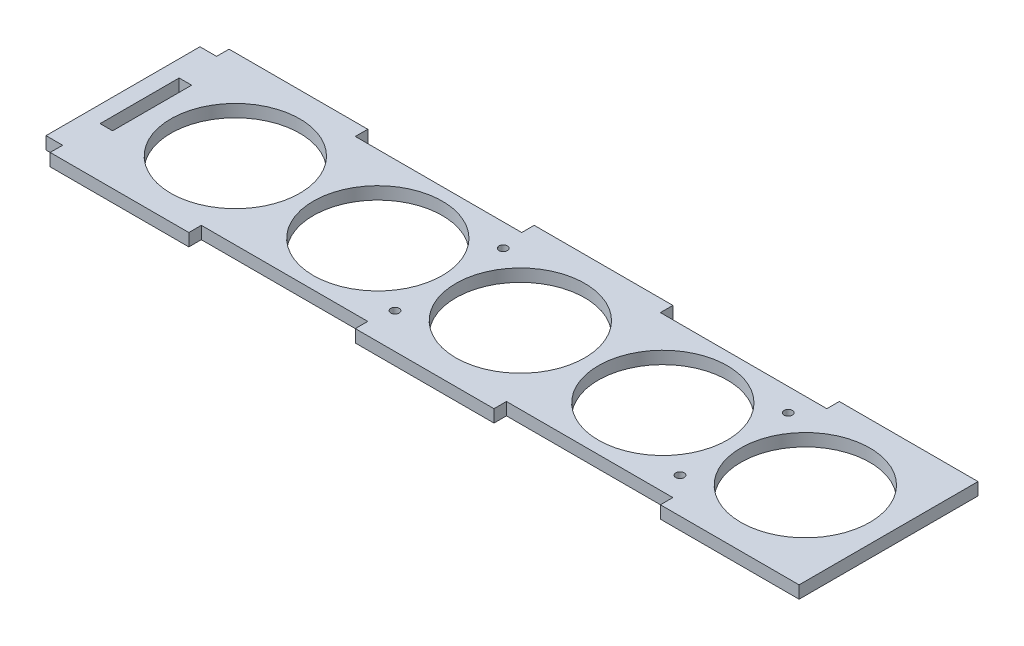
ISO-10303-21;
HEADER;
FILE_DESCRIPTION(('STEP AP214'),'2;1');
FILE_NAME('part.step','',(''),(''),'','','');
FILE_SCHEMA(('AUTOMOTIVE_DESIGN { 1 0 10303 214 1 1 1 1 }'));
ENDSEC;
DATA;
#1=APPLICATION_CONTEXT('core data for automotive mechanical design processes');
#2=APPLICATION_PROTOCOL_DEFINITION('international standard','automotive_design',2000,#1);
#3=PRODUCT_CONTEXT('',#1,'mechanical');
#4=PRODUCT('Part','Part','',(#3));
#5=PRODUCT_RELATED_PRODUCT_CATEGORY('part','',(#4));
#6=PRODUCT_DEFINITION_FORMATION('','',#4);
#7=PRODUCT_DEFINITION_CONTEXT('part definition',#1,'design');
#8=PRODUCT_DEFINITION('design','',#6,#7);
#9=PRODUCT_DEFINITION_SHAPE('','',#8);
#10=(LENGTH_UNIT() NAMED_UNIT(*) SI_UNIT(.MILLI.,.METRE.));
#11=(NAMED_UNIT(*) PLANE_ANGLE_UNIT() SI_UNIT($,.RADIAN.));
#12=(NAMED_UNIT(*) SI_UNIT($,.STERADIAN.) SOLID_ANGLE_UNIT());
#13=UNCERTAINTY_MEASURE_WITH_UNIT(LENGTH_MEASURE(1.E-05),#10,'distance_accuracy_value','');
#14=(GEOMETRIC_REPRESENTATION_CONTEXT(3) GLOBAL_UNCERTAINTY_ASSIGNED_CONTEXT((#13)) GLOBAL_UNIT_ASSIGNED_CONTEXT((#10,
#11,#12)) REPRESENTATION_CONTEXT('',''));
#15=CARTESIAN_POINT('',(0.,0.,0.));
#16=DIRECTION('',(0.,0.,1.));
#17=DIRECTION('',(1.,0.,0.));
#18=AXIS2_PLACEMENT_3D('',#15,#16,#17);
#19=CARTESIAN_POINT('',(74.375,3.,13.));
#20=DIRECTION('',(0.,-1.,0.));
#21=DIRECTION('',(0.,0.,-1.));
#22=AXIS2_PLACEMENT_3D('',#19,#20,#21);
#23=CYLINDRICAL_SURFACE('',#22,0.999999999999998);
#24=CARTESIAN_POINT('',(74.375,3.,13.));
#25=DIRECTION('',(0.,1.,0.));
#26=DIRECTION('',(0.,0.,1.));
#27=AXIS2_PLACEMENT_3D('',#24,#25,#26);
#28=CIRCLE('',#27,0.999999999999998);
#29=CARTESIAN_POINT('',(74.375,3.,14.));
#30=VERTEX_POINT('',#29);
#31=EDGE_CURVE('E150',#30,#30,#28,.F.);
#32=ORIENTED_EDGE('',*,*,#31,.F.);
#33=EDGE_LOOP('',(#32));
#34=FACE_BOUND('',#33,.T.);
#35=CARTESIAN_POINT('',(74.375,0.,13.));
#36=DIRECTION('',(0.,1.,0.));
#37=DIRECTION('',(0.,0.,1.));
#38=AXIS2_PLACEMENT_3D('',#35,#36,#37);
#39=CIRCLE('',#38,0.999999999999998);
#40=CARTESIAN_POINT('',(74.375,0.,14.));
#41=VERTEX_POINT('',#40);
#42=EDGE_CURVE('E243',#41,#41,#39,.F.);
#43=ORIENTED_EDGE('',*,*,#42,.T.);
#44=EDGE_LOOP('',(#43));
#45=FACE_BOUND('',#44,.T.);
#46=ADVANCED_FACE('F39',(#34,#45),#23,.F.);
#47=CARTESIAN_POINT('',(33.3333333333333,3.,0.));
#48=DIRECTION('',(-1.,0.,0.));
#49=DIRECTION('',(0.,0.,1.));
#50=AXIS2_PLACEMENT_3D('',#47,#48,#49);
#51=PLANE('',#50);
#52=DIRECTION('',(0.,0.,-1.));
#53=VECTOR('',#52,1.);
#54=CARTESIAN_POINT('',(33.3333333333333,0.,0.));
#55=LINE('',#54,#53);
#56=CARTESIAN_POINT('',(33.3333333333333,0.,21.5));
#57=VERTEX_POINT('',#56);
#58=CARTESIAN_POINT('',(33.3333333333333,0.,18.5));
#59=VERTEX_POINT('',#58);
#60=EDGE_CURVE('E186',#57,#59,#55,.T.);
#61=ORIENTED_EDGE('',*,*,#60,.T.);
#62=DIRECTION('',(0.,-1.,0.));
#63=VECTOR('',#62,1.);
#64=CARTESIAN_POINT('',(33.3333333333333,3.,18.5));
#65=LINE('',#64,#63);
#66=CARTESIAN_POINT('',(33.3333333333333,3.,18.5));
#67=VERTEX_POINT('',#66);
#68=EDGE_CURVE('E307',#67,#59,#65,.T.);
#69=ORIENTED_EDGE('',*,*,#68,.F.);
#70=DIRECTION('',(0.,0.,-1.));
#71=VECTOR('',#70,1.);
#72=CARTESIAN_POINT('',(33.3333333333333,3.,0.));
#73=LINE('',#72,#71);
#74=CARTESIAN_POINT('',(33.3333333333333,3.,21.5));
#75=VERTEX_POINT('',#74);
#76=EDGE_CURVE('E536',#75,#67,#73,.T.);
#77=ORIENTED_EDGE('',*,*,#76,.F.);
#78=DIRECTION('',(0.,-1.,0.));
#79=VECTOR('',#78,1.);
#80=CARTESIAN_POINT('',(33.3333333333333,3.,21.5));
#81=LINE('',#80,#79);
#82=EDGE_CURVE('E310',#75,#57,#81,.T.);
#83=ORIENTED_EDGE('',*,*,#82,.T.);
#84=EDGE_LOOP('',(#61,#69,#77,#83));
#85=FACE_BOUND('',#84,.T.);
#86=ADVANCED_FACE('F433',(#85),#51,.F.);
#87=CARTESIAN_POINT('',(0.,3.,18.5));
#88=DIRECTION('',(0.,0.,-1.));
#89=DIRECTION('',(-1.,0.,0.));
#90=AXIS2_PLACEMENT_3D('',#87,#88,#89);
#91=PLANE('',#90);
#92=DIRECTION('',(1.,0.,0.));
#93=VECTOR('',#92,1.);
#94=CARTESIAN_POINT('',(0.,0.,18.5));
#95=LINE('',#94,#93);
#96=CARTESIAN_POINT('',(73.3333333333333,0.,18.5));
#97=VERTEX_POINT('',#96);
#98=EDGE_CURVE('E191',#59,#97,#95,.T.);
#99=ORIENTED_EDGE('',*,*,#98,.T.);
#100=DIRECTION('',(0.,-1.,0.));
#101=VECTOR('',#100,1.);
#102=CARTESIAN_POINT('',(73.3333333333333,3.,18.5));
#103=LINE('',#102,#101);
#104=CARTESIAN_POINT('',(73.3333333333333,3.,18.5));
#105=VERTEX_POINT('',#104);
#106=EDGE_CURVE('E304',#105,#97,#103,.T.);
#107=ORIENTED_EDGE('',*,*,#106,.F.);
#108=DIRECTION('',(1.,0.,0.));
#109=VECTOR('',#108,1.);
#110=CARTESIAN_POINT('',(0.,3.,18.5));
#111=LINE('',#110,#109);
#112=EDGE_CURVE('E530',#67,#105,#111,.T.);
#113=ORIENTED_EDGE('',*,*,#112,.F.);
#114=ORIENTED_EDGE('',*,*,#68,.T.);
#115=EDGE_LOOP('',(#99,#107,#113,#114));
#116=FACE_BOUND('',#115,.T.);
#117=ADVANCED_FACE('F439',(#116),#91,.F.);
#118=CARTESIAN_POINT('',(73.3333333333333,3.,0.));
#119=DIRECTION('',(-1.,0.,0.));
#120=DIRECTION('',(0.,0.,1.));
#121=AXIS2_PLACEMENT_3D('',#118,#119,#120);
#122=PLANE('',#121);
#123=DIRECTION('',(0.,0.,-1.));
#124=VECTOR('',#123,1.);
#125=CARTESIAN_POINT('',(73.3333333333333,0.,0.));
#126=LINE('',#125,#124);
#127=CARTESIAN_POINT('',(73.3333333333333,0.,21.5));
#128=VERTEX_POINT('',#127);
#129=EDGE_CURVE('E194',#128,#97,#126,.T.);
#130=ORIENTED_EDGE('',*,*,#129,.F.);
#131=DIRECTION('',(0.,-1.,0.));
#132=VECTOR('',#131,1.);
#133=CARTESIAN_POINT('',(73.3333333333333,3.,21.5));
#134=LINE('',#133,#132);
#135=CARTESIAN_POINT('',(73.3333333333333,3.,21.5));
#136=VERTEX_POINT('',#135);
#137=EDGE_CURVE('E301',#136,#128,#134,.T.);
#138=ORIENTED_EDGE('',*,*,#137,.F.);
#139=DIRECTION('',(0.,0.,-1.));
#140=VECTOR('',#139,1.);
#141=CARTESIAN_POINT('',(73.3333333333333,3.,0.));
#142=LINE('',#141,#140);
#143=EDGE_CURVE('E523',#136,#105,#142,.T.);
#144=ORIENTED_EDGE('',*,*,#143,.T.);
#145=ORIENTED_EDGE('',*,*,#106,.T.);
#146=EDGE_LOOP('',(#130,#138,#144,#145));
#147=FACE_BOUND('',#146,.T.);
#148=ADVANCED_FACE('F503',(#147),#122,.T.);
#149=CARTESIAN_POINT('',(0.,3.,21.5));
#150=DIRECTION('',(0.,0.,-1.));
#151=DIRECTION('',(-1.,0.,0.));
#152=AXIS2_PLACEMENT_3D('',#149,#150,#151);
#153=PLANE('',#152);
#154=DIRECTION('',(1.,0.,0.));
#155=VECTOR('',#154,1.);
#156=CARTESIAN_POINT('',(0.,0.,21.5));
#157=LINE('',#156,#155);
#158=CARTESIAN_POINT('',(106.666666666667,0.,21.4999999999999));
#159=VERTEX_POINT('',#158);
#160=EDGE_CURVE('E188',#128,#159,#157,.T.);
#161=ORIENTED_EDGE('',*,*,#160,.T.);
#162=DIRECTION('',(0.,-1.,0.));
#163=VECTOR('',#162,1.);
#164=CARTESIAN_POINT('',(106.666666666667,3.,21.4999999999999));
#165=LINE('',#164,#163);
#166=CARTESIAN_POINT('',(106.666666666667,3.,21.4999999999999));
#167=VERTEX_POINT('',#166);
#168=EDGE_CURVE('E298',#167,#159,#165,.T.);
#169=ORIENTED_EDGE('',*,*,#168,.F.);
#170=DIRECTION('',(1.,0.,0.));
#171=VECTOR('',#170,1.);
#172=CARTESIAN_POINT('',(0.,3.,21.5));
#173=LINE('',#172,#171);
#174=EDGE_CURVE('E529',#136,#167,#173,.T.);
#175=ORIENTED_EDGE('',*,*,#174,.F.);
#176=ORIENTED_EDGE('',*,*,#137,.T.);
#177=EDGE_LOOP('',(#161,#169,#175,#176));
#178=FACE_BOUND('',#177,.T.);
#179=ADVANCED_FACE('F413',(#178),#153,.F.);
#180=CARTESIAN_POINT('',(106.666666666667,3.,0.));
#181=DIRECTION('',(-1.,0.,0.));
#182=DIRECTION('',(0.,0.,1.));
#183=AXIS2_PLACEMENT_3D('',#180,#181,#182);
#184=PLANE('',#183);
#185=DIRECTION('',(0.,0.,-1.));
#186=VECTOR('',#185,1.);
#187=CARTESIAN_POINT('',(106.666666666667,0.,0.));
#188=LINE('',#187,#186);
#189=CARTESIAN_POINT('',(106.666666666667,0.,18.5));
#190=VERTEX_POINT('',#189);
#191=EDGE_CURVE('E197',#159,#190,#188,.T.);
#192=ORIENTED_EDGE('',*,*,#191,.T.);
#193=DIRECTION('',(0.,-1.,0.));
#194=VECTOR('',#193,1.);
#195=CARTESIAN_POINT('',(106.666666666667,3.,18.5));
#196=LINE('',#195,#194);
#197=CARTESIAN_POINT('',(106.666666666667,3.,18.5));
#198=VERTEX_POINT('',#197);
#199=EDGE_CURVE('E295',#198,#190,#196,.T.);
#200=ORIENTED_EDGE('',*,*,#199,.F.);
#201=DIRECTION('',(0.,0.,-1.));
#202=VECTOR('',#201,1.);
#203=CARTESIAN_POINT('',(106.666666666667,3.,0.));
#204=LINE('',#203,#202);
#205=EDGE_CURVE('E532',#167,#198,#204,.T.);
#206=ORIENTED_EDGE('',*,*,#205,.F.);
#207=ORIENTED_EDGE('',*,*,#168,.T.);
#208=EDGE_LOOP('',(#192,#200,#206,#207));
#209=FACE_BOUND('',#208,.T.);
#210=ADVANCED_FACE('F498',(#209),#184,.F.);
#211=CARTESIAN_POINT('',(0.,3.,18.5));
#212=DIRECTION('',(0.,0.,-1.));
#213=DIRECTION('',(-1.,0.,0.));
#214=AXIS2_PLACEMENT_3D('',#211,#212,#213);
#215=PLANE('',#214);
#216=DIRECTION('',(1.,0.,0.));
#217=VECTOR('',#216,1.);
#218=CARTESIAN_POINT('',(0.,0.,18.5));
#219=LINE('',#218,#217);
#220=CARTESIAN_POINT('',(146.666666666667,0.,18.5));
#221=VERTEX_POINT('',#220);
#222=EDGE_CURVE('E200',#190,#221,#219,.T.);
#223=ORIENTED_EDGE('',*,*,#222,.T.);
#224=DIRECTION('',(0.,-1.,0.));
#225=VECTOR('',#224,1.);
#226=CARTESIAN_POINT('',(146.666666666667,3.,18.5));
#227=LINE('',#226,#225);
#228=CARTESIAN_POINT('',(146.666666666667,3.,18.5));
#229=VERTEX_POINT('',#228);
#230=EDGE_CURVE('E292',#229,#221,#227,.T.);
#231=ORIENTED_EDGE('',*,*,#230,.F.);
#232=DIRECTION('',(1.,0.,0.));
#233=VECTOR('',#232,1.);
#234=CARTESIAN_POINT('',(0.,3.,18.5));
#235=LINE('',#234,#233);
#236=EDGE_CURVE('E542',#198,#229,#235,.T.);
#237=ORIENTED_EDGE('',*,*,#236,.F.);
#238=ORIENTED_EDGE('',*,*,#199,.T.);
#239=EDGE_LOOP('',(#223,#231,#237,#238));
#240=FACE_BOUND('',#239,.T.);
#241=ADVANCED_FACE('F494',(#240),#215,.F.);
#242=CARTESIAN_POINT('',(146.666666666667,3.,0.));
#243=DIRECTION('',(-1.,0.,0.));
#244=DIRECTION('',(0.,0.,1.));
#245=AXIS2_PLACEMENT_3D('',#242,#243,#244);
#246=PLANE('',#245);
#247=DIRECTION('',(0.,0.,-1.));
#248=VECTOR('',#247,1.);
#249=CARTESIAN_POINT('',(146.666666666667,0.,0.));
#250=LINE('',#249,#248);
#251=CARTESIAN_POINT('',(146.666666666667,0.,21.4999999999999));
#252=VERTEX_POINT('',#251);
#253=EDGE_CURVE('E203',#252,#221,#250,.T.);
#254=ORIENTED_EDGE('',*,*,#253,.F.);
#255=DIRECTION('',(0.,-1.,0.));
#256=VECTOR('',#255,1.);
#257=CARTESIAN_POINT('',(146.666666666667,3.,21.4999999999999));
#258=LINE('',#257,#256);
#259=CARTESIAN_POINT('',(146.666666666667,3.,21.4999999999999));
#260=VERTEX_POINT('',#259);
#261=EDGE_CURVE('E289',#260,#252,#258,.T.);
#262=ORIENTED_EDGE('',*,*,#261,.F.);
#263=DIRECTION('',(0.,0.,-1.));
#264=VECTOR('',#263,1.);
#265=CARTESIAN_POINT('',(146.666666666667,3.,0.));
#266=LINE('',#265,#264);
#267=EDGE_CURVE('E545',#260,#229,#266,.T.);
#268=ORIENTED_EDGE('',*,*,#267,.T.);
#269=ORIENTED_EDGE('',*,*,#230,.T.);
#270=EDGE_LOOP('',(#254,#262,#268,#269));
#271=FACE_BOUND('',#270,.T.);
#272=ADVANCED_FACE('F490',(#271),#246,.T.);
#273=CARTESIAN_POINT('',(180.,0.,21.4999999999999));
#274=VERTEX_POINT('',#273);
#275=EDGE_CURVE('E187',#252,#274,#157,.T.);
#276=ORIENTED_EDGE('',*,*,#275,.T.);
#277=DIRECTION('',(0.,-1.,0.));
#278=VECTOR('',#277,1.);
#279=CARTESIAN_POINT('',(180.,3.,21.4999999999999));
#280=LINE('',#279,#278);
#281=CARTESIAN_POINT('',(180.,3.,21.4999999999999));
#282=VERTEX_POINT('',#281);
#283=EDGE_CURVE('E286',#282,#274,#280,.T.);
#284=ORIENTED_EDGE('',*,*,#283,.F.);
#285=EDGE_CURVE('E535',#260,#282,#173,.T.);
#286=ORIENTED_EDGE('',*,*,#285,.F.);
#287=ORIENTED_EDGE('',*,*,#261,.T.);
#288=EDGE_LOOP('',(#276,#284,#286,#287));
#289=FACE_BOUND('',#288,.T.);
#290=ADVANCED_FACE('F414',(#289),#153,.F.);
#291=CARTESIAN_POINT('',(180.,3.,0.));
#292=DIRECTION('',(1.,0.,0.));
#293=DIRECTION('',(0.,0.,-1.));
#294=AXIS2_PLACEMENT_3D('',#291,#292,#293);
#295=PLANE('',#294);
#296=DIRECTION('',(0.,0.,1.));
#297=VECTOR('',#296,1.);
#298=CARTESIAN_POINT('',(180.,0.,0.));
#299=LINE('',#298,#297);
#300=CARTESIAN_POINT('',(180.,0.,-21.5));
#301=VERTEX_POINT('',#300);
#302=EDGE_CURVE('E206',#301,#274,#299,.T.);
#303=ORIENTED_EDGE('',*,*,#302,.F.);
#304=DIRECTION('',(0.,-1.,0.));
#305=VECTOR('',#304,1.);
#306=CARTESIAN_POINT('',(180.,3.,-21.5));
#307=LINE('',#306,#305);
#308=CARTESIAN_POINT('',(180.,3.,-21.5));
#309=VERTEX_POINT('',#308);
#310=EDGE_CURVE('E283',#309,#301,#307,.T.);
#311=ORIENTED_EDGE('',*,*,#310,.F.);
#312=DIRECTION('',(0.,0.,1.));
#313=VECTOR('',#312,1.);
#314=CARTESIAN_POINT('',(180.,3.,0.));
#315=LINE('',#314,#313);
#316=EDGE_CURVE('E548',#309,#282,#315,.T.);
#317=ORIENTED_EDGE('',*,*,#316,.T.);
#318=ORIENTED_EDGE('',*,*,#283,.T.);
#319=EDGE_LOOP('',(#303,#311,#317,#318));
#320=FACE_BOUND('',#319,.T.);
#321=ADVANCED_FACE('F485',(#320),#295,.T.);
#322=CARTESIAN_POINT('',(0.,3.,-21.5));
#323=DIRECTION('',(0.,0.,-1.));
#324=DIRECTION('',(-1.,0.,0.));
#325=AXIS2_PLACEMENT_3D('',#322,#323,#324);
#326=PLANE('',#325);
#327=DIRECTION('',(1.,0.,0.));
#328=VECTOR('',#327,1.);
#329=CARTESIAN_POINT('',(0.,0.,-21.5));
#330=LINE('',#329,#328);
#331=CARTESIAN_POINT('',(146.666666666667,0.,-21.5));
#332=VERTEX_POINT('',#331);
#333=EDGE_CURVE('E209',#332,#301,#330,.T.);
#334=ORIENTED_EDGE('',*,*,#333,.F.);
#335=DIRECTION('',(0.,-1.,0.));
#336=VECTOR('',#335,1.);
#337=CARTESIAN_POINT('',(146.666666666667,3.,-21.5));
#338=LINE('',#337,#336);
#339=CARTESIAN_POINT('',(146.666666666667,3.,-21.5));
#340=VERTEX_POINT('',#339);
#341=EDGE_CURVE('E280',#340,#332,#338,.T.);
#342=ORIENTED_EDGE('',*,*,#341,.F.);
#343=DIRECTION('',(1.,0.,0.));
#344=VECTOR('',#343,1.);
#345=CARTESIAN_POINT('',(0.,3.,-21.5));
#346=LINE('',#345,#344);
#347=EDGE_CURVE('E551',#340,#309,#346,.T.);
#348=ORIENTED_EDGE('',*,*,#347,.T.);
#349=ORIENTED_EDGE('',*,*,#310,.T.);
#350=EDGE_LOOP('',(#334,#342,#348,#349));
#351=FACE_BOUND('',#350,.T.);
#352=ADVANCED_FACE('F460',(#351),#326,.T.);
#353=CARTESIAN_POINT('',(146.666666666667,3.,0.));
#354=DIRECTION('',(1.,0.,0.));
#355=DIRECTION('',(0.,0.,-1.));
#356=AXIS2_PLACEMENT_3D('',#353,#354,#355);
#357=PLANE('',#356);
#358=DIRECTION('',(0.,0.,1.));
#359=VECTOR('',#358,1.);
#360=CARTESIAN_POINT('',(146.666666666667,0.,0.));
#361=LINE('',#360,#359);
#362=CARTESIAN_POINT('',(146.666666666667,0.,-18.5));
#363=VERTEX_POINT('',#362);
#364=EDGE_CURVE('E212',#332,#363,#361,.T.);
#365=ORIENTED_EDGE('',*,*,#364,.T.);
#366=DIRECTION('',(0.,-1.,0.));
#367=VECTOR('',#366,1.);
#368=CARTESIAN_POINT('',(146.666666666667,3.,-18.5));
#369=LINE('',#368,#367);
#370=CARTESIAN_POINT('',(146.666666666667,3.,-18.5));
#371=VERTEX_POINT('',#370);
#372=EDGE_CURVE('E277',#371,#363,#369,.T.);
#373=ORIENTED_EDGE('',*,*,#372,.F.);
#374=DIRECTION('',(0.,0.,1.));
#375=VECTOR('',#374,1.);
#376=CARTESIAN_POINT('',(146.666666666667,3.,0.));
#377=LINE('',#376,#375);
#378=EDGE_CURVE('E554',#340,#371,#377,.T.);
#379=ORIENTED_EDGE('',*,*,#378,.F.);
#380=ORIENTED_EDGE('',*,*,#341,.T.);
#381=EDGE_LOOP('',(#365,#373,#379,#380));
#382=FACE_BOUND('',#381,.T.);
#383=ADVANCED_FACE('F480',(#382),#357,.F.);
#384=CARTESIAN_POINT('',(0.,3.,-18.5));
#385=DIRECTION('',(0.,0.,-1.));
#386=DIRECTION('',(-1.,0.,0.));
#387=AXIS2_PLACEMENT_3D('',#384,#385,#386);
#388=PLANE('',#387);
#389=DIRECTION('',(1.,0.,0.));
#390=VECTOR('',#389,1.);
#391=CARTESIAN_POINT('',(0.,0.,-18.5));
#392=LINE('',#391,#390);
#393=CARTESIAN_POINT('',(106.666666666667,0.,-18.5));
#394=VERTEX_POINT('',#393);
#395=EDGE_CURVE('E217',#394,#363,#392,.T.);
#396=ORIENTED_EDGE('',*,*,#395,.F.);
#397=DIRECTION('',(0.,-1.,0.));
#398=VECTOR('',#397,1.);
#399=CARTESIAN_POINT('',(106.666666666667,3.,-18.5));
#400=LINE('',#399,#398);
#401=CARTESIAN_POINT('',(106.666666666667,3.,-18.5));
#402=VERTEX_POINT('',#401);
#403=EDGE_CURVE('E274',#402,#394,#400,.T.);
#404=ORIENTED_EDGE('',*,*,#403,.F.);
#405=DIRECTION('',(1.,0.,0.));
#406=VECTOR('',#405,1.);
#407=CARTESIAN_POINT('',(0.,3.,-18.5));
#408=LINE('',#407,#406);
#409=EDGE_CURVE('E559',#402,#371,#408,.T.);
#410=ORIENTED_EDGE('',*,*,#409,.T.);
#411=ORIENTED_EDGE('',*,*,#372,.T.);
#412=EDGE_LOOP('',(#396,#404,#410,#411));
#413=FACE_BOUND('',#412,.T.);
#414=ADVANCED_FACE('F476',(#413),#388,.T.);
#415=CARTESIAN_POINT('',(106.666666666667,3.,0.));
#416=DIRECTION('',(1.,0.,0.));
#417=DIRECTION('',(0.,0.,-1.));
#418=AXIS2_PLACEMENT_3D('',#415,#416,#417);
#419=PLANE('',#418);
#420=DIRECTION('',(0.,0.,1.));
#421=VECTOR('',#420,1.);
#422=CARTESIAN_POINT('',(106.666666666667,0.,0.));
#423=LINE('',#422,#421);
#424=CARTESIAN_POINT('',(106.666666666667,0.,-21.5));
#425=VERTEX_POINT('',#424);
#426=EDGE_CURVE('E220',#425,#394,#423,.T.);
#427=ORIENTED_EDGE('',*,*,#426,.F.);
#428=DIRECTION('',(0.,-1.,0.));
#429=VECTOR('',#428,1.);
#430=CARTESIAN_POINT('',(106.666666666667,3.,-21.5));
#431=LINE('',#430,#429);
#432=CARTESIAN_POINT('',(106.666666666667,3.,-21.5));
#433=VERTEX_POINT('',#432);
#434=EDGE_CURVE('E271',#433,#425,#431,.T.);
#435=ORIENTED_EDGE('',*,*,#434,.F.);
#436=DIRECTION('',(0.,0.,1.));
#437=VECTOR('',#436,1.);
#438=CARTESIAN_POINT('',(106.666666666667,3.,0.));
#439=LINE('',#438,#437);
#440=EDGE_CURVE('E562',#433,#402,#439,.T.);
#441=ORIENTED_EDGE('',*,*,#440,.T.);
#442=ORIENTED_EDGE('',*,*,#403,.T.);
#443=EDGE_LOOP('',(#427,#435,#441,#442));
#444=FACE_BOUND('',#443,.T.);
#445=ADVANCED_FACE('F473',(#444),#419,.T.);
#446=CARTESIAN_POINT('',(73.3333333333333,0.,-21.5));
#447=VERTEX_POINT('',#446);
#448=EDGE_CURVE('E214',#447,#425,#330,.T.);
#449=ORIENTED_EDGE('',*,*,#448,.F.);
#450=DIRECTION('',(0.,-1.,0.));
#451=VECTOR('',#450,1.);
#452=CARTESIAN_POINT('',(73.3333333333333,3.,-21.5));
#453=LINE('',#452,#451);
#454=CARTESIAN_POINT('',(73.3333333333333,3.,-21.5));
#455=VERTEX_POINT('',#454);
#456=EDGE_CURVE('E268',#455,#447,#453,.T.);
#457=ORIENTED_EDGE('',*,*,#456,.F.);
#458=EDGE_CURVE('E556',#455,#433,#346,.T.);
#459=ORIENTED_EDGE('',*,*,#458,.T.);
#460=ORIENTED_EDGE('',*,*,#434,.T.);
#461=EDGE_LOOP('',(#449,#457,#459,#460));
#462=FACE_BOUND('',#461,.T.);
#463=ADVANCED_FACE('F461',(#462),#326,.T.);
#464=CARTESIAN_POINT('',(73.3333333333333,3.,0.));
#465=DIRECTION('',(1.,0.,0.));
#466=DIRECTION('',(0.,0.,-1.));
#467=AXIS2_PLACEMENT_3D('',#464,#465,#466);
#468=PLANE('',#467);
#469=DIRECTION('',(0.,0.,1.));
#470=VECTOR('',#469,1.);
#471=CARTESIAN_POINT('',(73.3333333333333,0.,0.));
#472=LINE('',#471,#470);
#473=CARTESIAN_POINT('',(73.3333333333333,0.,-18.5));
#474=VERTEX_POINT('',#473);
#475=EDGE_CURVE('E223',#447,#474,#472,.T.);
#476=ORIENTED_EDGE('',*,*,#475,.T.);
#477=DIRECTION('',(0.,-1.,0.));
#478=VECTOR('',#477,1.);
#479=CARTESIAN_POINT('',(73.3333333333333,3.,-18.5));
#480=LINE('',#479,#478);
#481=CARTESIAN_POINT('',(73.3333333333333,3.,-18.5));
#482=VERTEX_POINT('',#481);
#483=EDGE_CURVE('E265',#482,#474,#480,.T.);
#484=ORIENTED_EDGE('',*,*,#483,.F.);
#485=DIRECTION('',(0.,0.,1.));
#486=VECTOR('',#485,1.);
#487=CARTESIAN_POINT('',(73.3333333333333,3.,0.));
#488=LINE('',#487,#486);
#489=EDGE_CURVE('E565',#455,#482,#488,.T.);
#490=ORIENTED_EDGE('',*,*,#489,.F.);
#491=ORIENTED_EDGE('',*,*,#456,.T.);
#492=EDGE_LOOP('',(#476,#484,#490,#491));
#493=FACE_BOUND('',#492,.T.);
#494=ADVANCED_FACE('F468',(#493),#468,.F.);
#495=CARTESIAN_POINT('',(0.,3.,-18.5));
#496=DIRECTION('',(0.,0.,-1.));
#497=DIRECTION('',(-1.,0.,0.));
#498=AXIS2_PLACEMENT_3D('',#495,#496,#497);
#499=PLANE('',#498);
#500=DIRECTION('',(1.,0.,0.));
#501=VECTOR('',#500,1.);
#502=CARTESIAN_POINT('',(0.,0.,-18.5));
#503=LINE('',#502,#501);
#504=CARTESIAN_POINT('',(33.3333333333333,0.,-18.5));
#505=VERTEX_POINT('',#504);
#506=EDGE_CURVE('E226',#505,#474,#503,.T.);
#507=ORIENTED_EDGE('',*,*,#506,.F.);
#508=DIRECTION('',(0.,-1.,0.));
#509=VECTOR('',#508,1.);
#510=CARTESIAN_POINT('',(33.3333333333333,3.,-18.5));
#511=LINE('',#510,#509);
#512=CARTESIAN_POINT('',(33.3333333333333,3.,-18.5));
#513=VERTEX_POINT('',#512);
#514=EDGE_CURVE('E262',#513,#505,#511,.T.);
#515=ORIENTED_EDGE('',*,*,#514,.F.);
#516=DIRECTION('',(1.,0.,0.));
#517=VECTOR('',#516,1.);
#518=CARTESIAN_POINT('',(0.,3.,-18.5));
#519=LINE('',#518,#517);
#520=EDGE_CURVE('E568',#513,#482,#519,.T.);
#521=ORIENTED_EDGE('',*,*,#520,.T.);
#522=ORIENTED_EDGE('',*,*,#483,.T.);
#523=EDGE_LOOP('',(#507,#515,#521,#522));
#524=FACE_BOUND('',#523,.T.);
#525=ADVANCED_FACE('F464',(#524),#499,.T.);
#526=CARTESIAN_POINT('',(33.3333333333333,3.,0.));
#527=DIRECTION('',(1.,0.,0.));
#528=DIRECTION('',(0.,0.,-1.));
#529=AXIS2_PLACEMENT_3D('',#526,#527,#528);
#530=PLANE('',#529);
#531=DIRECTION('',(0.,0.,1.));
#532=VECTOR('',#531,1.);
#533=CARTESIAN_POINT('',(33.3333333333333,0.,0.));
#534=LINE('',#533,#532);
#535=CARTESIAN_POINT('',(33.3333333333333,0.,-21.5));
#536=VERTEX_POINT('',#535);
#537=EDGE_CURVE('E229',#536,#505,#534,.T.);
#538=ORIENTED_EDGE('',*,*,#537,.F.);
#539=DIRECTION('',(0.,-1.,0.));
#540=VECTOR('',#539,1.);
#541=CARTESIAN_POINT('',(33.3333333333333,3.,-21.5));
#542=LINE('',#541,#540);
#543=CARTESIAN_POINT('',(33.3333333333333,3.,-21.5));
#544=VERTEX_POINT('',#543);
#545=EDGE_CURVE('E259',#544,#536,#542,.T.);
#546=ORIENTED_EDGE('',*,*,#545,.F.);
#547=DIRECTION('',(0.,0.,1.));
#548=VECTOR('',#547,1.);
#549=CARTESIAN_POINT('',(33.3333333333333,3.,0.));
#550=LINE('',#549,#548);
#551=EDGE_CURVE('E571',#544,#513,#550,.T.);
#552=ORIENTED_EDGE('',*,*,#551,.T.);
#553=ORIENTED_EDGE('',*,*,#514,.T.);
#554=EDGE_LOOP('',(#538,#546,#552,#553));
#555=FACE_BOUND('',#554,.T.);
#556=ADVANCED_FACE('F458',(#555),#530,.T.);
#557=CARTESIAN_POINT('',(0.,0.,-21.5));
#558=VERTEX_POINT('',#557);
#559=EDGE_CURVE('E213',#558,#536,#330,.T.);
#560=ORIENTED_EDGE('',*,*,#559,.F.);
#561=DIRECTION('',(0.,-1.,0.));
#562=VECTOR('',#561,1.);
#563=CARTESIAN_POINT('',(0.,3.,-21.5));
#564=LINE('',#563,#562);
#565=CARTESIAN_POINT('',(0.,3.,-21.5));
#566=VERTEX_POINT('',#565);
#567=EDGE_CURVE('E256',#566,#558,#564,.T.);
#568=ORIENTED_EDGE('',*,*,#567,.F.);
#569=EDGE_CURVE('E555',#566,#544,#346,.T.);
#570=ORIENTED_EDGE('',*,*,#569,.T.);
#571=ORIENTED_EDGE('',*,*,#545,.T.);
#572=EDGE_LOOP('',(#560,#568,#570,#571));
#573=FACE_BOUND('',#572,.T.);
#574=ADVANCED_FACE('F455',(#573),#326,.T.);
#575=CARTESIAN_POINT('',(0.,3.,0.));
#576=DIRECTION('',(1.,0.,0.));
#577=DIRECTION('',(0.,0.,-1.));
#578=AXIS2_PLACEMENT_3D('',#575,#576,#577);
#579=PLANE('',#578);
#580=DIRECTION('',(0.,-1.,0.));
#581=VECTOR('',#580,1.);
#582=CARTESIAN_POINT('',(0.,3.,-18.5));
#583=LINE('',#582,#581);
#584=CARTESIAN_POINT('',(0.,3.,-18.5));
#585=VERTEX_POINT('',#584);
#586=CARTESIAN_POINT('',(0.,0.,-18.5));
#587=VERTEX_POINT('',#586);
#588=EDGE_CURVE('E11',#585,#587,#583,.T.);
#589=ORIENTED_EDGE('',*,*,#588,.F.);
#590=DIRECTION('',(0.,0.,1.));
#591=VECTOR('',#590,1.);
#592=CARTESIAN_POINT('',(0.,3.,0.));
#593=LINE('',#592,#591);
#594=EDGE_CURVE('E152',#566,#585,#593,.T.);
#595=ORIENTED_EDGE('',*,*,#594,.F.);
#596=ORIENTED_EDGE('',*,*,#567,.T.);
#597=DIRECTION('',(0.,0.,1.));
#598=VECTOR('',#597,1.);
#599=CARTESIAN_POINT('',(0.,0.,0.));
#600=LINE('',#599,#598);
#601=EDGE_CURVE('E232',#558,#587,#600,.T.);
#602=ORIENTED_EDGE('',*,*,#601,.T.);
#603=EDGE_LOOP('',(#589,#595,#596,#602));
#604=FACE_BOUND('',#603,.T.);
#605=ADVANCED_FACE('F446',(#604),#579,.F.);
#606=CARTESIAN_POINT('',(0.,3.,-9.5));
#607=DIRECTION('',(0.,0.,-1.));
#608=DIRECTION('',(-1.,0.,0.));
#609=AXIS2_PLACEMENT_3D('',#606,#607,#608);
#610=PLANE('',#609);
#611=DIRECTION('',(1.,0.,0.));
#612=VECTOR('',#611,1.);
#613=CARTESIAN_POINT('',(0.,0.,-9.5));
#614=LINE('',#613,#612);
#615=CARTESIAN_POINT('',(0.,0.,-9.5));
#616=VERTEX_POINT('',#615);
#617=CARTESIAN_POINT('',(3.,0.,-9.5));
#618=VERTEX_POINT('',#617);
#619=EDGE_CURVE('E234',#616,#618,#614,.T.);
#620=ORIENTED_EDGE('',*,*,#619,.T.);
#621=DIRECTION('',(0.,-1.,0.));
#622=VECTOR('',#621,1.);
#623=CARTESIAN_POINT('',(3.,3.,-9.5));
#624=LINE('',#623,#622);
#625=CARTESIAN_POINT('',(3.,3.,-9.5));
#626=VERTEX_POINT('',#625);
#627=EDGE_CURVE('E252',#626,#618,#624,.T.);
#628=ORIENTED_EDGE('',*,*,#627,.F.);
#629=DIRECTION('',(1.,0.,0.));
#630=VECTOR('',#629,1.);
#631=CARTESIAN_POINT('',(0.,3.,-9.5));
#632=LINE('',#631,#630);
#633=CARTESIAN_POINT('',(0.,3.,-9.5));
#634=VERTEX_POINT('',#633);
#635=EDGE_CURVE('E153',#634,#626,#632,.T.);
#636=ORIENTED_EDGE('',*,*,#635,.F.);
#637=DIRECTION('',(0.,-1.,0.));
#638=VECTOR('',#637,1.);
#639=CARTESIAN_POINT('',(0.,3.,-9.5));
#640=LINE('',#639,#638);
#641=EDGE_CURVE('E131',#634,#616,#640,.T.);
#642=ORIENTED_EDGE('',*,*,#641,.T.);
#643=EDGE_LOOP('',(#620,#628,#636,#642));
#644=FACE_BOUND('',#643,.T.);
#645=ADVANCED_FACE('F451',(#644),#610,.F.);
#646=CARTESIAN_POINT('',(3.,3.,0.));
#647=DIRECTION('',(-1.,0.,0.));
#648=DIRECTION('',(0.,0.,1.));
#649=AXIS2_PLACEMENT_3D('',#646,#647,#648);
#650=PLANE('',#649);
#651=DIRECTION('',(0.,0.,-1.));
#652=VECTOR('',#651,1.);
#653=CARTESIAN_POINT('',(3.,0.,0.));
#654=LINE('',#653,#652);
#655=CARTESIAN_POINT('',(3.,0.,9.5));
#656=VERTEX_POINT('',#655);
#657=EDGE_CURVE('E238',#656,#618,#654,.T.);
#658=ORIENTED_EDGE('',*,*,#657,.F.);
#659=DIRECTION('',(0.,-1.,0.));
#660=VECTOR('',#659,1.);
#661=CARTESIAN_POINT('',(3.,3.,9.5));
#662=LINE('',#661,#660);
#663=CARTESIAN_POINT('',(3.,3.,9.5));
#664=VERTEX_POINT('',#663);
#665=EDGE_CURVE('E250',#664,#656,#662,.T.);
#666=ORIENTED_EDGE('',*,*,#665,.F.);
#667=DIRECTION('',(0.,0.,-1.));
#668=VECTOR('',#667,1.);
#669=CARTESIAN_POINT('',(3.,3.,0.));
#670=LINE('',#669,#668);
#671=EDGE_CURVE('E144',#664,#626,#670,.T.);
#672=ORIENTED_EDGE('',*,*,#671,.T.);
#673=ORIENTED_EDGE('',*,*,#627,.T.);
#674=EDGE_LOOP('',(#658,#666,#672,#673));
#675=FACE_BOUND('',#674,.T.);
#676=ADVANCED_FACE('F378',(#675),#650,.T.);
#677=CARTESIAN_POINT('',(0.,3.,9.5));
#678=DIRECTION('',(0.,0.,-1.));
#679=DIRECTION('',(-1.,0.,0.));
#680=AXIS2_PLACEMENT_3D('',#677,#678,#679);
#681=PLANE('',#680);
#682=DIRECTION('',(1.,0.,0.));
#683=VECTOR('',#682,1.);
#684=CARTESIAN_POINT('',(0.,0.,9.5));
#685=LINE('',#684,#683);
#686=CARTESIAN_POINT('',(0.,0.,9.5));
#687=VERTEX_POINT('',#686);
#688=EDGE_CURVE('E241',#687,#656,#685,.T.);
#689=ORIENTED_EDGE('',*,*,#688,.F.);
#690=DIRECTION('',(0.,-1.,0.));
#691=VECTOR('',#690,1.);
#692=CARTESIAN_POINT('',(0.,3.,9.5));
#693=LINE('',#692,#691);
#694=CARTESIAN_POINT('',(0.,3.,9.5));
#695=VERTEX_POINT('',#694);
#696=EDGE_CURVE('E128',#695,#687,#693,.T.);
#697=ORIENTED_EDGE('',*,*,#696,.F.);
#698=DIRECTION('',(1.,0.,0.));
#699=VECTOR('',#698,1.);
#700=CARTESIAN_POINT('',(0.,3.,9.5));
#701=LINE('',#700,#699);
#702=EDGE_CURVE('E140',#695,#664,#701,.T.);
#703=ORIENTED_EDGE('',*,*,#702,.T.);
#704=ORIENTED_EDGE('',*,*,#665,.T.);
#705=EDGE_LOOP('',(#689,#697,#703,#704));
#706=FACE_BOUND('',#705,.T.);
#707=ADVANCED_FACE('F376',(#706),#681,.T.);
#708=CARTESIAN_POINT('',(0.,3.,18.5));
#709=VERTEX_POINT('',#708);
#710=CARTESIAN_POINT('',(0.,3.,21.5));
#711=VERTEX_POINT('',#710);
#712=EDGE_CURVE('E147',#709,#711,#593,.T.);
#713=ORIENTED_EDGE('',*,*,#712,.F.);
#714=DIRECTION('',(0.,-1.,0.));
#715=VECTOR('',#714,1.);
#716=CARTESIAN_POINT('',(0.,3.,18.5));
#717=LINE('',#716,#715);
#718=CARTESIAN_POINT('',(0.,0.,18.5));
#719=VERTEX_POINT('',#718);
#720=EDGE_CURVE('E49',#709,#719,#717,.T.);
#721=ORIENTED_EDGE('',*,*,#720,.T.);
#722=CARTESIAN_POINT('',(0.,0.,21.5));
#723=VERTEX_POINT('',#722);
#724=EDGE_CURVE('E235',#719,#723,#600,.T.);
#725=ORIENTED_EDGE('',*,*,#724,.T.);
#726=DIRECTION('',(0.,-1.,0.));
#727=VECTOR('',#726,1.);
#728=CARTESIAN_POINT('',(0.,3.,21.5));
#729=LINE('',#728,#727);
#730=EDGE_CURVE('E159',#711,#723,#729,.T.);
#731=ORIENTED_EDGE('',*,*,#730,.F.);
#732=EDGE_LOOP('',(#713,#721,#725,#731));
#733=FACE_BOUND('',#732,.T.);
#734=ADVANCED_FACE('F316',(#733),#579,.F.);
#735=EDGE_CURVE('E183',#723,#57,#157,.T.);
#736=ORIENTED_EDGE('',*,*,#735,.T.);
#737=ORIENTED_EDGE('',*,*,#82,.F.);
#738=EDGE_CURVE('E534',#711,#75,#173,.T.);
#739=ORIENTED_EDGE('',*,*,#738,.F.);
#740=ORIENTED_EDGE('',*,*,#730,.T.);
#741=EDGE_LOOP('',(#736,#737,#739,#740));
#742=FACE_BOUND('',#741,.T.);
#743=ADVANCED_FACE('F326',(#742),#153,.F.);
#744=CARTESIAN_POINT('',(23.,3.,0.));
#745=DIRECTION('',(0.,-1.,0.));
#746=DIRECTION('',(0.,0.,-1.));
#747=AXIS2_PLACEMENT_3D('',#744,#745,#746);
#748=CYLINDRICAL_SURFACE('',#747,15.5);
#749=CARTESIAN_POINT('',(23.,3.,0.));
#750=DIRECTION('',(0.,1.,0.));
#751=DIRECTION('',(0.,0.,1.));
#752=AXIS2_PLACEMENT_3D('',#749,#750,#751);
#753=CIRCLE('',#752,15.5);
#754=CARTESIAN_POINT('',(23.,3.,15.5));
#755=VERTEX_POINT('',#754);
#756=EDGE_CURVE('E625',#755,#755,#753,.T.);
#757=ORIENTED_EDGE('',*,*,#756,.T.);
#758=EDGE_LOOP('',(#757));
#759=FACE_BOUND('',#758,.T.);
#760=CARTESIAN_POINT('',(23.,0.,0.));
#761=DIRECTION('',(0.,1.,0.));
#762=DIRECTION('',(0.,0.,1.));
#763=AXIS2_PLACEMENT_3D('',#760,#761,#762);
#764=CIRCLE('',#763,15.5);
#765=CARTESIAN_POINT('',(23.,0.,15.5));
#766=VERTEX_POINT('',#765);
#767=EDGE_CURVE('E180',#766,#766,#764,.T.);
#768=ORIENTED_EDGE('',*,*,#767,.F.);
#769=EDGE_LOOP('',(#768));
#770=FACE_BOUND('',#769,.T.);
#771=ADVANCED_FACE('F400',(#759,#770),#748,.F.);
#772=CARTESIAN_POINT('',(57.25,3.,0.));
#773=DIRECTION('',(0.,-1.,0.));
#774=DIRECTION('',(0.,0.,-1.));
#775=AXIS2_PLACEMENT_3D('',#772,#773,#774);
#776=CYLINDRICAL_SURFACE('',#775,15.5);
#777=CARTESIAN_POINT('',(57.25,3.,0.));
#778=DIRECTION('',(0.,1.,0.));
#779=DIRECTION('',(0.,0.,1.));
#780=AXIS2_PLACEMENT_3D('',#777,#778,#779);
#781=CIRCLE('',#780,15.5);
#782=CARTESIAN_POINT('',(57.25,3.,15.5));
#783=VERTEX_POINT('',#782);
#784=EDGE_CURVE('E626',#783,#783,#781,.T.);
#785=ORIENTED_EDGE('',*,*,#784,.T.);
#786=EDGE_LOOP('',(#785));
#787=FACE_BOUND('',#786,.T.);
#788=CARTESIAN_POINT('',(57.25,0.,0.));
#789=DIRECTION('',(0.,1.,0.));
#790=DIRECTION('',(0.,0.,1.));
#791=AXIS2_PLACEMENT_3D('',#788,#789,#790);
#792=CIRCLE('',#791,15.5);
#793=CARTESIAN_POINT('',(57.25,0.,15.5));
#794=VERTEX_POINT('',#793);
#795=EDGE_CURVE('E177',#794,#794,#792,.T.);
#796=ORIENTED_EDGE('',*,*,#795,.F.);
#797=EDGE_LOOP('',(#796));
#798=FACE_BOUND('',#797,.T.);
#799=ADVANCED_FACE('F402',(#787,#798),#776,.F.);
#800=CARTESIAN_POINT('',(91.5,3.,0.));
#801=DIRECTION('',(0.,-1.,0.));
#802=DIRECTION('',(0.,0.,-1.));
#803=AXIS2_PLACEMENT_3D('',#800,#801,#802);
#804=CYLINDRICAL_SURFACE('',#803,15.5);
#805=CARTESIAN_POINT('',(91.5,3.,0.));
#806=DIRECTION('',(0.,1.,0.));
#807=DIRECTION('',(0.,0.,1.));
#808=AXIS2_PLACEMENT_3D('',#805,#806,#807);
#809=CIRCLE('',#808,15.5);
#810=CARTESIAN_POINT('',(91.5,3.,15.5));
#811=VERTEX_POINT('',#810);
#812=EDGE_CURVE('E1019',#811,#811,#809,.T.);
#813=ORIENTED_EDGE('',*,*,#812,.T.);
#814=EDGE_LOOP('',(#813));
#815=FACE_BOUND('',#814,.T.);
#816=CARTESIAN_POINT('',(91.5,0.,0.));
#817=DIRECTION('',(0.,1.,0.));
#818=DIRECTION('',(0.,0.,1.));
#819=AXIS2_PLACEMENT_3D('',#816,#817,#818);
#820=CIRCLE('',#819,15.5);
#821=CARTESIAN_POINT('',(91.5,0.,15.5));
#822=VERTEX_POINT('',#821);
#823=EDGE_CURVE('E174',#822,#822,#820,.T.);
#824=ORIENTED_EDGE('',*,*,#823,.F.);
#825=EDGE_LOOP('',(#824));
#826=FACE_BOUND('',#825,.T.);
#827=ADVANCED_FACE('F409',(#815,#826),#804,.F.);
#828=CARTESIAN_POINT('',(125.75,3.,0.));
#829=DIRECTION('',(0.,-1.,0.));
#830=DIRECTION('',(0.,0.,-1.));
#831=AXIS2_PLACEMENT_3D('',#828,#829,#830);
#832=CYLINDRICAL_SURFACE('',#831,15.5);
#833=CARTESIAN_POINT('',(125.75,3.,0.));
#834=DIRECTION('',(0.,1.,0.));
#835=DIRECTION('',(0.,0.,1.));
#836=AXIS2_PLACEMENT_3D('',#833,#834,#835);
#837=CIRCLE('',#836,15.5);
#838=CARTESIAN_POINT('',(125.75,3.,15.5));
#839=VERTEX_POINT('',#838);
#840=EDGE_CURVE('E1016',#839,#839,#837,.T.);
#841=ORIENTED_EDGE('',*,*,#840,.T.);
#842=EDGE_LOOP('',(#841));
#843=FACE_BOUND('',#842,.T.);
#844=CARTESIAN_POINT('',(125.75,0.,0.));
#845=DIRECTION('',(0.,1.,0.));
#846=DIRECTION('',(0.,0.,1.));
#847=AXIS2_PLACEMENT_3D('',#844,#845,#846);
#848=CIRCLE('',#847,15.5);
#849=CARTESIAN_POINT('',(125.75,0.,15.5));
#850=VERTEX_POINT('',#849);
#851=EDGE_CURVE('E171',#850,#850,#848,.T.);
#852=ORIENTED_EDGE('',*,*,#851,.F.);
#853=EDGE_LOOP('',(#852));
#854=FACE_BOUND('',#853,.T.);
#855=ADVANCED_FACE('F781',(#843,#854),#832,.F.);
#856=CARTESIAN_POINT('',(160.,3.,0.));
#857=DIRECTION('',(0.,-1.,0.));
#858=DIRECTION('',(0.,0.,-1.));
#859=AXIS2_PLACEMENT_3D('',#856,#857,#858);
#860=CYLINDRICAL_SURFACE('',#859,15.5);
#861=CARTESIAN_POINT('',(160.,3.,0.));
#862=DIRECTION('',(0.,1.,0.));
#863=DIRECTION('',(0.,0.,1.));
#864=AXIS2_PLACEMENT_3D('',#861,#862,#863);
#865=CIRCLE('',#864,15.5);
#866=CARTESIAN_POINT('',(160.,3.,15.5));
#867=VERTEX_POINT('',#866);
#868=EDGE_CURVE('E1013',#867,#867,#865,.T.);
#869=ORIENTED_EDGE('',*,*,#868,.T.);
#870=EDGE_LOOP('',(#869));
#871=FACE_BOUND('',#870,.T.);
#872=CARTESIAN_POINT('',(160.,0.,0.));
#873=DIRECTION('',(0.,1.,0.));
#874=DIRECTION('',(0.,0.,1.));
#875=AXIS2_PLACEMENT_3D('',#872,#873,#874);
#876=CIRCLE('',#875,15.5);
#877=CARTESIAN_POINT('',(160.,0.,15.5));
#878=VERTEX_POINT('',#877);
#879=EDGE_CURVE('E168',#878,#878,#876,.T.);
#880=ORIENTED_EDGE('',*,*,#879,.F.);
#881=EDGE_LOOP('',(#880));
#882=FACE_BOUND('',#881,.T.);
#883=ADVANCED_FACE('F792',(#871,#882),#860,.F.);
#884=CARTESIAN_POINT('',(74.375,3.,-13.));
#885=DIRECTION('',(0.,-1.,0.));
#886=DIRECTION('',(0.,0.,-1.));
#887=AXIS2_PLACEMENT_3D('',#884,#885,#886);
#888=CYLINDRICAL_SURFACE('',#887,0.999999999999998);
#889=CARTESIAN_POINT('',(74.375,3.,-13.));
#890=DIRECTION('',(0.,1.,0.));
#891=DIRECTION('',(0.,0.,1.));
#892=AXIS2_PLACEMENT_3D('',#889,#890,#891);
#893=CIRCLE('',#892,0.999999999999998);
#894=CARTESIAN_POINT('',(74.375,3.,-12.));
#895=VERTEX_POINT('',#894);
#896=EDGE_CURVE('E1008',#895,#895,#893,.T.);
#897=ORIENTED_EDGE('',*,*,#896,.T.);
#898=EDGE_LOOP('',(#897));
#899=FACE_BOUND('',#898,.T.);
#900=CARTESIAN_POINT('',(74.375,0.,-13.));
#901=DIRECTION('',(0.,1.,0.));
#902=DIRECTION('',(0.,0.,1.));
#903=AXIS2_PLACEMENT_3D('',#900,#901,#902);
#904=CIRCLE('',#903,0.999999999999998);
#905=CARTESIAN_POINT('',(74.375,0.,-12.));
#906=VERTEX_POINT('',#905);
#907=EDGE_CURVE('E165',#906,#906,#904,.T.);
#908=ORIENTED_EDGE('',*,*,#907,.F.);
#909=EDGE_LOOP('',(#908));
#910=FACE_BOUND('',#909,.T.);
#911=ADVANCED_FACE('F803',(#899,#910),#888,.F.);
#912=CARTESIAN_POINT('',(142.875,3.,-13.));
#913=DIRECTION('',(0.,-1.,0.));
#914=DIRECTION('',(0.,0.,-1.));
#915=AXIS2_PLACEMENT_3D('',#912,#913,#914);
#916=CYLINDRICAL_SURFACE('',#915,0.999999999999998);
#917=CARTESIAN_POINT('',(142.875,3.,-13.));
#918=DIRECTION('',(0.,1.,0.));
#919=DIRECTION('',(0.,0.,1.));
#920=AXIS2_PLACEMENT_3D('',#917,#918,#919);
#921=CIRCLE('',#920,0.999999999999998);
#922=CARTESIAN_POINT('',(142.875,3.,-12.));
#923=VERTEX_POINT('',#922);
#924=EDGE_CURVE('E1005',#923,#923,#921,.T.);
#925=ORIENTED_EDGE('',*,*,#924,.T.);
#926=EDGE_LOOP('',(#925));
#927=FACE_BOUND('',#926,.T.);
#928=CARTESIAN_POINT('',(142.875,0.,-13.));
#929=DIRECTION('',(0.,1.,0.));
#930=DIRECTION('',(0.,0.,1.));
#931=AXIS2_PLACEMENT_3D('',#928,#929,#930);
#932=CIRCLE('',#931,0.999999999999998);
#933=CARTESIAN_POINT('',(142.875,0.,-12.));
#934=VERTEX_POINT('',#933);
#935=EDGE_CURVE('E162',#934,#934,#932,.T.);
#936=ORIENTED_EDGE('',*,*,#935,.F.);
#937=EDGE_LOOP('',(#936));
#938=FACE_BOUND('',#937,.T.);
#939=ADVANCED_FACE('F814',(#927,#938),#916,.F.);
#940=CARTESIAN_POINT('',(142.875,3.,13.));
#941=DIRECTION('',(0.,-1.,0.));
#942=DIRECTION('',(0.,0.,-1.));
#943=AXIS2_PLACEMENT_3D('',#940,#941,#942);
#944=CYLINDRICAL_SURFACE('',#943,0.999999999999998);
#945=CARTESIAN_POINT('',(142.875,3.,13.));
#946=DIRECTION('',(0.,1.,0.));
#947=DIRECTION('',(0.,0.,1.));
#948=AXIS2_PLACEMENT_3D('',#945,#946,#947);
#949=CIRCLE('',#948,0.999999999999998);
#950=CARTESIAN_POINT('',(142.875,3.,14.));
#951=VERTEX_POINT('',#950);
#952=EDGE_CURVE('E246',#951,#951,#949,.F.);
#953=ORIENTED_EDGE('',*,*,#952,.F.);
#954=EDGE_LOOP('',(#953));
#955=FACE_BOUND('',#954,.T.);
#956=CARTESIAN_POINT('',(142.875,0.,13.));
#957=DIRECTION('',(0.,1.,0.));
#958=DIRECTION('',(0.,0.,1.));
#959=AXIS2_PLACEMENT_3D('',#956,#957,#958);
#960=CIRCLE('',#959,0.999999999999998);
#961=CARTESIAN_POINT('',(142.875,0.,14.));
#962=VERTEX_POINT('',#961);
#963=EDGE_CURVE('E95',#962,#962,#960,.F.);
#964=ORIENTED_EDGE('',*,*,#963,.T.);
#965=EDGE_LOOP('',(#964));
#966=FACE_BOUND('',#965,.T.);
#967=ADVANCED_FACE('F382',(#955,#966),#944,.F.);
#968=CARTESIAN_POINT('',(0.,0.,0.));
#969=DIRECTION('',(0.,1.,0.));
#970=DIRECTION('',(0.,0.,1.));
#971=AXIS2_PLACEMENT_3D('',#968,#969,#970);
#972=PLANE('',#971);
#973=ORIENTED_EDGE('',*,*,#619,.F.);
#974=DIRECTION('',(0.,0.,1.));
#975=VECTOR('',#974,1.);
#976=CARTESIAN_POINT('',(0.,0.,-18.5));
#977=LINE('',#976,#975);
#978=EDGE_CURVE('E88',#616,#687,#977,.T.);
#979=ORIENTED_EDGE('',*,*,#978,.T.);
#980=ORIENTED_EDGE('',*,*,#688,.T.);
#981=ORIENTED_EDGE('',*,*,#657,.T.);
#982=EDGE_LOOP('',(#973,#979,#980,#981));
#983=FACE_BOUND('',#982,.T.);
#984=ORIENTED_EDGE('',*,*,#963,.F.);
#985=EDGE_LOOP('',(#984));
#986=FACE_BOUND('',#985,.T.);
#987=ORIENTED_EDGE('',*,*,#935,.T.);
#988=EDGE_LOOP('',(#987));
#989=FACE_BOUND('',#988,.T.);
#990=ORIENTED_EDGE('',*,*,#907,.T.);
#991=EDGE_LOOP('',(#990));
#992=FACE_BOUND('',#991,.T.);
#993=ORIENTED_EDGE('',*,*,#879,.T.);
#994=EDGE_LOOP('',(#993));
#995=FACE_BOUND('',#994,.T.);
#996=ORIENTED_EDGE('',*,*,#851,.T.);
#997=EDGE_LOOP('',(#996));
#998=FACE_BOUND('',#997,.T.);
#999=ORIENTED_EDGE('',*,*,#823,.T.);
#1000=EDGE_LOOP('',(#999));
#1001=FACE_BOUND('',#1000,.T.);
#1002=ORIENTED_EDGE('',*,*,#795,.T.);
#1003=EDGE_LOOP('',(#1002));
#1004=FACE_BOUND('',#1003,.T.);
#1005=ORIENTED_EDGE('',*,*,#767,.T.);
#1006=EDGE_LOOP('',(#1005));
#1007=FACE_BOUND('',#1006,.T.);
#1008=ORIENTED_EDGE('',*,*,#735,.F.);
#1009=ORIENTED_EDGE('',*,*,#724,.F.);
#1010=DIRECTION('',(-1.,0.,0.));
#1011=VECTOR('',#1010,1.);
#1012=CARTESIAN_POINT('',(0.,0.,18.5));
#1013=LINE('',#1012,#1011);
#1014=CARTESIAN_POINT('',(-4.00000000000001,0.,18.5));
#1015=VERTEX_POINT('',#1014);
#1016=EDGE_CURVE('E100',#719,#1015,#1013,.T.);
#1017=ORIENTED_EDGE('',*,*,#1016,.T.);
#1018=DIRECTION('',(0.,0.,1.));
#1019=VECTOR('',#1018,1.);
#1020=CARTESIAN_POINT('',(-4.00000000000001,0.,-18.5));
#1021=LINE('',#1020,#1019);
#1022=CARTESIAN_POINT('',(-4.00000000000001,0.,-18.5));
#1023=VERTEX_POINT('',#1022);
#1024=EDGE_CURVE('E89',#1023,#1015,#1021,.T.);
#1025=ORIENTED_EDGE('',*,*,#1024,.F.);
#1026=DIRECTION('',(-1.,0.,0.));
#1027=VECTOR('',#1026,1.);
#1028=CARTESIAN_POINT('',(0.,0.,-18.5));
#1029=LINE('',#1028,#1027);
#1030=EDGE_CURVE('E78',#587,#1023,#1029,.T.);
#1031=ORIENTED_EDGE('',*,*,#1030,.F.);
#1032=ORIENTED_EDGE('',*,*,#601,.F.);
#1033=ORIENTED_EDGE('',*,*,#559,.T.);
#1034=ORIENTED_EDGE('',*,*,#537,.T.);
#1035=ORIENTED_EDGE('',*,*,#506,.T.);
#1036=ORIENTED_EDGE('',*,*,#475,.F.);
#1037=ORIENTED_EDGE('',*,*,#448,.T.);
#1038=ORIENTED_EDGE('',*,*,#426,.T.);
#1039=ORIENTED_EDGE('',*,*,#395,.T.);
#1040=ORIENTED_EDGE('',*,*,#364,.F.);
#1041=ORIENTED_EDGE('',*,*,#333,.T.);
#1042=ORIENTED_EDGE('',*,*,#302,.T.);
#1043=ORIENTED_EDGE('',*,*,#275,.F.);
#1044=ORIENTED_EDGE('',*,*,#253,.T.);
#1045=ORIENTED_EDGE('',*,*,#222,.F.);
#1046=ORIENTED_EDGE('',*,*,#191,.F.);
#1047=ORIENTED_EDGE('',*,*,#160,.F.);
#1048=ORIENTED_EDGE('',*,*,#129,.T.);
#1049=ORIENTED_EDGE('',*,*,#98,.F.);
#1050=ORIENTED_EDGE('',*,*,#60,.F.);
#1051=EDGE_LOOP('',(#1008,#1009,#1017,#1025,#1031,#1032,#1033,#1034,#1035,#1036,#1037,#1038,
#1039,#1040,#1041,#1042,#1043,#1044,#1045,#1046,#1047,#1048,#1049,#1050));
#1052=FACE_BOUND('',#1051,.T.);
#1053=ORIENTED_EDGE('',*,*,#42,.F.);
#1054=EDGE_LOOP('',(#1053));
#1055=FACE_BOUND('',#1054,.T.);
#1056=ADVANCED_FACE('F97',(#983,#986,#989,#992,#995,#998,#1001,#1004,#1007,#1052,#1055),#972,.F.);
#1057=CARTESIAN_POINT('',(0.,3.,0.));
#1058=DIRECTION('',(0.,1.,0.));
#1059=DIRECTION('',(0.,0.,1.));
#1060=AXIS2_PLACEMENT_3D('',#1057,#1058,#1059);
#1061=PLANE('',#1060);
#1062=DIRECTION('',(0.,0.,1.));
#1063=VECTOR('',#1062,1.);
#1064=CARTESIAN_POINT('',(0.,3.,-18.5));
#1065=LINE('',#1064,#1063);
#1066=EDGE_CURVE('E118',#634,#695,#1065,.T.);
#1067=ORIENTED_EDGE('',*,*,#1066,.F.);
#1068=ORIENTED_EDGE('',*,*,#635,.T.);
#1069=ORIENTED_EDGE('',*,*,#671,.F.);
#1070=ORIENTED_EDGE('',*,*,#702,.F.);
#1071=EDGE_LOOP('',(#1067,#1068,#1069,#1070));
#1072=FACE_BOUND('',#1071,.T.);
#1073=ORIENTED_EDGE('',*,*,#952,.T.);
#1074=EDGE_LOOP('',(#1073));
#1075=FACE_BOUND('',#1074,.T.);
#1076=ORIENTED_EDGE('',*,*,#924,.F.);
#1077=EDGE_LOOP('',(#1076));
#1078=FACE_BOUND('',#1077,.T.);
#1079=ORIENTED_EDGE('',*,*,#896,.F.);
#1080=EDGE_LOOP('',(#1079));
#1081=FACE_BOUND('',#1080,.T.);
#1082=ORIENTED_EDGE('',*,*,#868,.F.);
#1083=EDGE_LOOP('',(#1082));
#1084=FACE_BOUND('',#1083,.T.);
#1085=ORIENTED_EDGE('',*,*,#840,.F.);
#1086=EDGE_LOOP('',(#1085));
#1087=FACE_BOUND('',#1086,.T.);
#1088=ORIENTED_EDGE('',*,*,#812,.F.);
#1089=EDGE_LOOP('',(#1088));
#1090=FACE_BOUND('',#1089,.T.);
#1091=ORIENTED_EDGE('',*,*,#784,.F.);
#1092=EDGE_LOOP('',(#1091));
#1093=FACE_BOUND('',#1092,.T.);
#1094=ORIENTED_EDGE('',*,*,#756,.F.);
#1095=EDGE_LOOP('',(#1094));
#1096=FACE_BOUND('',#1095,.T.);
#1097=ORIENTED_EDGE('',*,*,#738,.T.);
#1098=ORIENTED_EDGE('',*,*,#76,.T.);
#1099=ORIENTED_EDGE('',*,*,#112,.T.);
#1100=ORIENTED_EDGE('',*,*,#143,.F.);
#1101=ORIENTED_EDGE('',*,*,#174,.T.);
#1102=ORIENTED_EDGE('',*,*,#205,.T.);
#1103=ORIENTED_EDGE('',*,*,#236,.T.);
#1104=ORIENTED_EDGE('',*,*,#267,.F.);
#1105=ORIENTED_EDGE('',*,*,#285,.T.);
#1106=ORIENTED_EDGE('',*,*,#316,.F.);
#1107=ORIENTED_EDGE('',*,*,#347,.F.);
#1108=ORIENTED_EDGE('',*,*,#378,.T.);
#1109=ORIENTED_EDGE('',*,*,#409,.F.);
#1110=ORIENTED_EDGE('',*,*,#440,.F.);
#1111=ORIENTED_EDGE('',*,*,#458,.F.);
#1112=ORIENTED_EDGE('',*,*,#489,.T.);
#1113=ORIENTED_EDGE('',*,*,#520,.F.);
#1114=ORIENTED_EDGE('',*,*,#551,.F.);
#1115=ORIENTED_EDGE('',*,*,#569,.F.);
#1116=ORIENTED_EDGE('',*,*,#594,.T.);
#1117=DIRECTION('',(-1.,0.,0.));
#1118=VECTOR('',#1117,1.);
#1119=CARTESIAN_POINT('',(0.,3.,-18.5));
#1120=LINE('',#1119,#1118);
#1121=CARTESIAN_POINT('',(-4.00000000000001,3.,-18.5));
#1122=VERTEX_POINT('',#1121);
#1123=EDGE_CURVE('E114',#585,#1122,#1120,.T.);
#1124=ORIENTED_EDGE('',*,*,#1123,.T.);
#1125=DIRECTION('',(0.,0.,1.));
#1126=VECTOR('',#1125,1.);
#1127=CARTESIAN_POINT('',(-4.00000000000001,3.,-18.5));
#1128=LINE('',#1127,#1126);
#1129=CARTESIAN_POINT('',(-4.00000000000001,3.,18.5));
#1130=VERTEX_POINT('',#1129);
#1131=EDGE_CURVE('E94',#1122,#1130,#1128,.T.);
#1132=ORIENTED_EDGE('',*,*,#1131,.T.);
#1133=DIRECTION('',(-1.,0.,0.));
#1134=VECTOR('',#1133,1.);
#1135=CARTESIAN_POINT('',(0.,3.,18.5));
#1136=LINE('',#1135,#1134);
#1137=EDGE_CURVE('E106',#709,#1130,#1136,.T.);
#1138=ORIENTED_EDGE('',*,*,#1137,.F.);
#1139=ORIENTED_EDGE('',*,*,#712,.T.);
#1140=EDGE_LOOP('',(#1097,#1098,#1099,#1100,#1101,#1102,#1103,#1104,#1105,#1106,#1107,#1108,
#1109,#1110,#1111,#1112,#1113,#1114,#1115,#1116,#1124,#1132,#1138,#1139));
#1141=FACE_BOUND('',#1140,.T.);
#1142=ORIENTED_EDGE('',*,*,#31,.T.);
#1143=EDGE_LOOP('',(#1142));
#1144=FACE_BOUND('',#1143,.T.);
#1145=ADVANCED_FACE('F141',(#1072,#1075,#1078,#1081,#1084,#1087,#1090,#1093,#1096,#1141,#1144),
#1061,.T.);
#1146=CARTESIAN_POINT('',(0.,3.,-18.5));
#1147=DIRECTION('',(1.,0.,0.));
#1148=DIRECTION('',(0.,0.,-1.));
#1149=AXIS2_PLACEMENT_3D('',#1146,#1147,#1148);
#1150=PLANE('',#1149);
#1151=ORIENTED_EDGE('',*,*,#641,.F.);
#1152=ORIENTED_EDGE('',*,*,#1066,.T.);
#1153=ORIENTED_EDGE('',*,*,#696,.T.);
#1154=ORIENTED_EDGE('',*,*,#978,.F.);
#1155=EDGE_LOOP('',(#1151,#1152,#1153,#1154));
#1156=FACE_BOUND('',#1155,.T.);
#1157=ADVANCED_FACE('F126',(#1156),#1150,.T.);
#1158=CARTESIAN_POINT('',(0.,3.,-18.5));
#1159=DIRECTION('',(0.,0.,1.));
#1160=DIRECTION('',(1.,0.,0.));
#1161=AXIS2_PLACEMENT_3D('',#1158,#1159,#1160);
#1162=PLANE('',#1161);
#1163=ORIENTED_EDGE('',*,*,#1030,.T.);
#1164=DIRECTION('',(0.,-1.,0.));
#1165=VECTOR('',#1164,1.);
#1166=CARTESIAN_POINT('',(-4.00000000000001,3.,-18.5));
#1167=LINE('',#1166,#1165);
#1168=EDGE_CURVE('E82',#1122,#1023,#1167,.T.);
#1169=ORIENTED_EDGE('',*,*,#1168,.F.);
#1170=ORIENTED_EDGE('',*,*,#1123,.F.);
#1171=ORIENTED_EDGE('',*,*,#588,.T.);
#1172=EDGE_LOOP('',(#1163,#1169,#1170,#1171));
#1173=FACE_BOUND('',#1172,.T.);
#1174=ADVANCED_FACE('F80',(#1173),#1162,.F.);
#1175=CARTESIAN_POINT('',(-4.00000000000001,3.,-18.5));
#1176=DIRECTION('',(1.,0.,0.));
#1177=DIRECTION('',(0.,0.,-1.));
#1178=AXIS2_PLACEMENT_3D('',#1175,#1176,#1177);
#1179=PLANE('',#1178);
#1180=ORIENTED_EDGE('',*,*,#1024,.T.);
#1181=DIRECTION('',(0.,-1.,0.));
#1182=VECTOR('',#1181,1.);
#1183=CARTESIAN_POINT('',(-4.00000000000001,3.,18.5));
#1184=LINE('',#1183,#1182);
#1185=EDGE_CURVE('E43',#1130,#1015,#1184,.T.);
#1186=ORIENTED_EDGE('',*,*,#1185,.F.);
#1187=ORIENTED_EDGE('',*,*,#1131,.F.);
#1188=ORIENTED_EDGE('',*,*,#1168,.T.);
#1189=EDGE_LOOP('',(#1180,#1186,#1187,#1188));
#1190=FACE_BOUND('',#1189,.T.);
#1191=ADVANCED_FACE('F92',(#1190),#1179,.F.);
#1192=CARTESIAN_POINT('',(0.,3.,18.5));
#1193=DIRECTION('',(0.,0.,1.));
#1194=DIRECTION('',(1.,0.,0.));
#1195=AXIS2_PLACEMENT_3D('',#1192,#1193,#1194);
#1196=PLANE('',#1195);
#1197=ORIENTED_EDGE('',*,*,#1016,.F.);
#1198=ORIENTED_EDGE('',*,*,#720,.F.);
#1199=ORIENTED_EDGE('',*,*,#1137,.T.);
#1200=ORIENTED_EDGE('',*,*,#1185,.T.);
#1201=EDGE_LOOP('',(#1197,#1198,#1199,#1200));
#1202=FACE_BOUND('',#1201,.T.);
#1203=ADVANCED_FACE('F41',(#1202),#1196,.T.);
#1204=CLOSED_SHELL('',(#46,#86,#117,#148,#179,#210,#241,#272,#290,#321,#352,#383,#414,#445,#463,
#494,#525,#556,#574,#605,#645,#676,#707,#734,#743,#771,#799,#827,#855,#883,#911,#939,#967,#1056,
#1145,#1157,#1174,#1191,#1203));
#1205=MANIFOLD_SOLID_BREP('B2',#1204);
#1206=ADVANCED_BREP_SHAPE_REPRESENTATION('',(#18,#1205),#14);
#1207=SHAPE_DEFINITION_REPRESENTATION(#9,#1206);
ENDSEC;
END-ISO-10303-21;
